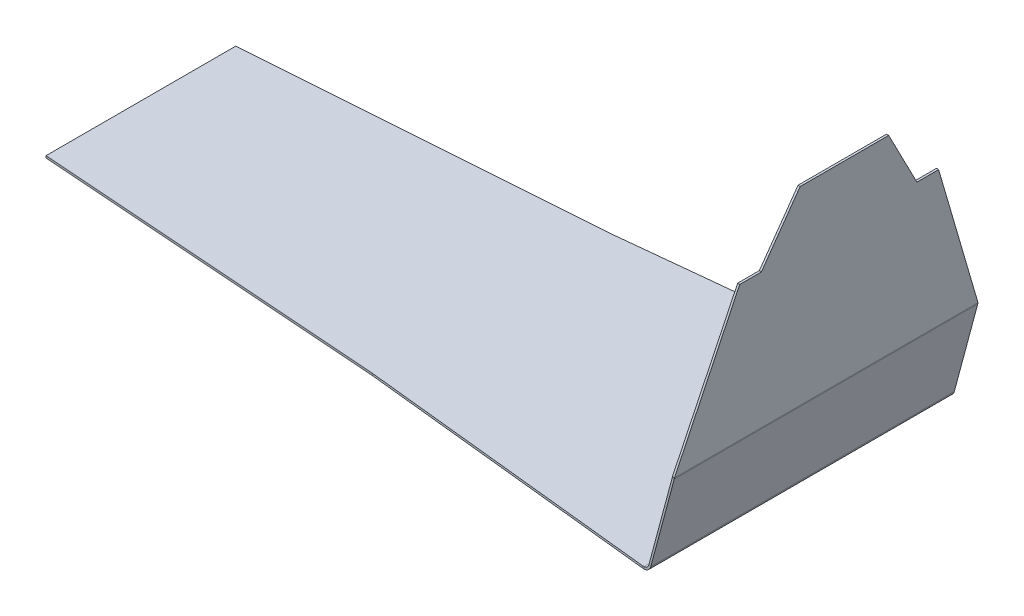
ISO-10303-21;
HEADER;
FILE_DESCRIPTION(('STEP AP214'),'2;1');
FILE_NAME('part.step','',(''),(''),'','','');
FILE_SCHEMA(('AUTOMOTIVE_DESIGN { 1 0 10303 214 1 1 1 1 }'));
ENDSEC;
DATA;
#1=APPLICATION_CONTEXT('core data for automotive mechanical design processes');
#2=APPLICATION_PROTOCOL_DEFINITION('international standard','automotive_design',2000,#1);
#3=PRODUCT_CONTEXT('',#1,'mechanical');
#4=PRODUCT('Part','Part','',(#3));
#5=PRODUCT_RELATED_PRODUCT_CATEGORY('part','',(#4));
#6=PRODUCT_DEFINITION_FORMATION('','',#4);
#7=PRODUCT_DEFINITION_CONTEXT('part definition',#1,'design');
#8=PRODUCT_DEFINITION('design','',#6,#7);
#9=PRODUCT_DEFINITION_SHAPE('','',#8);
#10=(LENGTH_UNIT() NAMED_UNIT(*) SI_UNIT(.MILLI.,.METRE.));
#11=(NAMED_UNIT(*) PLANE_ANGLE_UNIT() SI_UNIT($,.RADIAN.));
#12=(NAMED_UNIT(*) SI_UNIT($,.STERADIAN.) SOLID_ANGLE_UNIT());
#13=UNCERTAINTY_MEASURE_WITH_UNIT(LENGTH_MEASURE(1.E-05),#10,'distance_accuracy_value','');
#14=(GEOMETRIC_REPRESENTATION_CONTEXT(3) GLOBAL_UNCERTAINTY_ASSIGNED_CONTEXT((#13)) GLOBAL_UNIT_ASSIGNED_CONTEXT((#10,
#11,#12)) REPRESENTATION_CONTEXT('',''));
#15=CARTESIAN_POINT('',(0.,0.,0.));
#16=DIRECTION('',(0.,0.,1.));
#17=DIRECTION('',(1.,0.,0.));
#18=AXIS2_PLACEMENT_3D('',#15,#16,#17);
#19=CARTESIAN_POINT('',(446.934065691937,-39.1016640915989,-1.22240307231145E-13));
#20=DIRECTION('',(0.996194698091745,-0.0871557427476666,0.));
#21=DIRECTION('',(0.0871557427476666,0.996194698091745,0.));
#22=AXIS2_PLACEMENT_3D('',#19,#20,#21);
#23=PLANE('',#22);
#24=DIRECTION('',(0.,0.,-1.));
#25=VECTOR('',#24,1.);
#26=CARTESIAN_POINT('',(503.063220608211,602.45751231115,-300.));
#27=LINE('',#26,#25);
#28=CARTESIAN_POINT('',(503.063220608211,602.45751231115,87.5516477613444));
#29=VERTEX_POINT('',#28);
#30=CARTESIAN_POINT('',(503.063220608211,602.45751231115,-87.5516477613445));
#31=VERTEX_POINT('',#30);
#32=EDGE_CURVE('E331',#29,#31,#27,.T.);
#33=ORIENTED_EDGE('',*,*,#32,.F.);
#34=DIRECTION('',(-0.076110943801157,-0.869952068459671,0.487227383073281));
#35=VECTOR('',#34,1.);
#36=CARTESIAN_POINT('',(463.505302291546,150.308436963351,340.783312732004));
#37=LINE('',#36,#35);
#38=CARTESIAN_POINT('',(492.714619418007,484.172459446715,153.79865015754));
#39=VERTEX_POINT('',#38);
#40=EDGE_CURVE('E277',#29,#39,#37,.T.);
#41=ORIENTED_EDGE('',*,*,#40,.T.);
#42=DIRECTION('',(0.,0.,1.));
#43=VECTOR('',#42,1.);
#44=CARTESIAN_POINT('',(492.714619418008,484.172459446715,-1.81627154925868E-13));
#45=LINE('',#44,#43);
#46=CARTESIAN_POINT('',(492.714619418008,484.172459446715,196.591479546335));
#47=VERTEX_POINT('',#46);
#48=EDGE_CURVE('E284',#39,#47,#45,.T.);
#49=ORIENTED_EDGE('',*,*,#48,.T.);
#50=DIRECTION('',(-0.0821947035906193,-0.939489761050654,0.332570322762923));
#51=VECTOR('',#50,1.);
#52=CARTESIAN_POINT('',(457.37146331674,80.198336664604,339.594426434514));
#53=LINE('',#52,#51);
#54=CARTESIAN_POINT('',(467.157219657198,192.050043458108,300.));
#55=VERTEX_POINT('',#54);
#56=EDGE_CURVE('E271',#47,#55,#53,.T.);
#57=ORIENTED_EDGE('',*,*,#56,.T.);
#58=DIRECTION('',(0.,0.,-1.));
#59=VECTOR('',#58,1.);
#60=CARTESIAN_POINT('',(467.157219657198,192.050043458108,-2.5616833397339E-13));
#61=LINE('',#60,#59);
#62=CARTESIAN_POINT('',(467.157219657198,192.050043458108,-300.));
#63=VERTEX_POINT('',#62);
#64=EDGE_CURVE('E327',#55,#63,#61,.T.);
#65=ORIENTED_EDGE('',*,*,#64,.T.);
#66=DIRECTION('',(0.0821947035906195,0.939489761050654,0.332570322762923));
#67=VECTOR('',#66,1.);
#68=CARTESIAN_POINT('',(457.37146331674,80.1983366646043,-339.594426434515));
#69=LINE('',#68,#67);
#70=CARTESIAN_POINT('',(492.714619418007,484.172459446715,-196.591479546335));
#71=VERTEX_POINT('',#70);
#72=EDGE_CURVE('E300',#63,#71,#69,.T.);
#73=ORIENTED_EDGE('',*,*,#72,.T.);
#74=DIRECTION('',(0.,0.,1.));
#75=VECTOR('',#74,1.);
#76=CARTESIAN_POINT('',(492.714619418008,484.172459446715,-1.22240307231145E-13));
#77=LINE('',#76,#75);
#78=CARTESIAN_POINT('',(492.714619418008,484.172459446715,-153.79865015754));
#79=VERTEX_POINT('',#78);
#80=EDGE_CURVE('E307',#71,#79,#77,.T.);
#81=ORIENTED_EDGE('',*,*,#80,.T.);
#82=DIRECTION('',(0.0761109438011572,0.86995206845967,0.487227383073282));
#83=VECTOR('',#82,1.);
#84=CARTESIAN_POINT('',(463.505302291546,150.308436963352,-340.783312732004));
#85=LINE('',#84,#83);
#86=EDGE_CURVE('E294',#79,#31,#85,.T.);
#87=ORIENTED_EDGE('',*,*,#86,.T.);
#88=EDGE_LOOP('',(#33,#41,#49,#57,#65,#73,#81,#87));
#89=FACE_BOUND('',#88,.T.);
#90=ADVANCED_FACE('F61',(#89),#23,.T.);
#91=CARTESIAN_POINT('',(442.94928689957,-38.7530411206082,-1.21150435992368E-13));
#92=DIRECTION('',(0.996194698091745,-0.0871557427476666,0.));
#93=DIRECTION('',(0.0871557427476666,0.996194698091745,0.));
#94=AXIS2_PLACEMENT_3D('',#91,#92,#93);
#95=PLANE('',#94);
#96=DIRECTION('',(-0.076110943801157,-0.869952068459671,0.487227383073281));
#97=VECTOR('',#96,1.);
#98=CARTESIAN_POINT('',(459.520523499179,150.657059934342,340.783312732004));
#99=LINE('',#98,#97);
#100=CARTESIAN_POINT('',(499.078441815844,602.806135282141,87.5516477613445));
#101=VERTEX_POINT('',#100);
#102=CARTESIAN_POINT('',(488.729840625641,484.521082417706,153.79865015754));
#103=VERTEX_POINT('',#102);
#104=EDGE_CURVE('E278',#101,#103,#99,.T.);
#105=ORIENTED_EDGE('',*,*,#104,.F.);
#106=DIRECTION('',(0.,0.,-1.));
#107=VECTOR('',#106,1.);
#108=CARTESIAN_POINT('',(499.078441815844,602.80613528214,-300.));
#109=LINE('',#108,#107);
#110=CARTESIAN_POINT('',(499.078441815844,602.80613528214,-87.5516477613445));
#111=VERTEX_POINT('',#110);
#112=EDGE_CURVE('E77',#101,#111,#109,.T.);
#113=ORIENTED_EDGE('',*,*,#112,.T.);
#114=DIRECTION('',(0.0761109438011572,0.86995206845967,0.487227383073282));
#115=VECTOR('',#114,1.);
#116=CARTESIAN_POINT('',(459.520523499179,150.657059934342,-340.783312732004));
#117=LINE('',#116,#115);
#118=CARTESIAN_POINT('',(488.729840625641,484.521082417706,-153.79865015754));
#119=VERTEX_POINT('',#118);
#120=EDGE_CURVE('E297',#119,#111,#117,.T.);
#121=ORIENTED_EDGE('',*,*,#120,.F.);
#122=DIRECTION('',(0.,0.,1.));
#123=VECTOR('',#122,1.);
#124=CARTESIAN_POINT('',(488.729840625641,484.521082417706,-1.21150435992368E-13));
#125=LINE('',#124,#123);
#126=CARTESIAN_POINT('',(488.729840625641,484.521082417706,-196.591479546335));
#127=VERTEX_POINT('',#126);
#128=EDGE_CURVE('E299',#127,#119,#125,.T.);
#129=ORIENTED_EDGE('',*,*,#128,.F.);
#130=DIRECTION('',(0.0821947035906195,0.939489761050654,0.332570322762923));
#131=VECTOR('',#130,1.);
#132=CARTESIAN_POINT('',(453.386684524373,80.5469596355949,-339.594426434515));
#133=LINE('',#132,#131);
#134=CARTESIAN_POINT('',(463.172440864831,192.398666429099,-300.));
#135=VERTEX_POINT('',#134);
#136=EDGE_CURVE('E301',#135,#127,#133,.T.);
#137=ORIENTED_EDGE('',*,*,#136,.F.);
#138=DIRECTION('',(0.,0.,-1.));
#139=VECTOR('',#138,1.);
#140=CARTESIAN_POINT('',(463.172440864831,192.398666429099,300.));
#141=LINE('',#140,#139);
#142=CARTESIAN_POINT('',(463.172440864831,192.398666429099,300.));
#143=VERTEX_POINT('',#142);
#144=EDGE_CURVE('E321',#143,#135,#141,.T.);
#145=ORIENTED_EDGE('',*,*,#144,.F.);
#146=DIRECTION('',(-0.0821947035906193,-0.939489761050654,0.332570322762923));
#147=VECTOR('',#146,1.);
#148=CARTESIAN_POINT('',(453.386684524373,80.5469596355947,339.594426434514));
#149=LINE('',#148,#147);
#150=CARTESIAN_POINT('',(488.729840625641,484.521082417706,196.591479546335));
#151=VERTEX_POINT('',#150);
#152=EDGE_CURVE('E274',#151,#143,#149,.T.);
#153=ORIENTED_EDGE('',*,*,#152,.F.);
#154=DIRECTION('',(0.,0.,1.));
#155=VECTOR('',#154,1.);
#156=CARTESIAN_POINT('',(488.729840625641,484.521082417706,-1.21150435992368E-13));
#157=LINE('',#156,#155);
#158=EDGE_CURVE('E276',#103,#151,#157,.T.);
#159=ORIENTED_EDGE('',*,*,#158,.F.);
#160=EDGE_LOOP('',(#105,#113,#121,#129,#137,#145,#153,#159));
#161=FACE_BOUND('',#160,.T.);
#162=ADVANCED_FACE('F426',(#161),#95,.F.);
#163=CARTESIAN_POINT('',(503.063220608211,602.45751231115,-300.));
#164=DIRECTION('',(0.0871557427476667,0.996194698091745,0.));
#165=DIRECTION('',(-0.996194698091745,0.0871557427476667,0.));
#166=AXIS2_PLACEMENT_3D('',#163,#164,#165);
#167=PLANE('',#166);
#168=ORIENTED_EDGE('',*,*,#112,.F.);
#169=DIRECTION('',(0.996194698091745,-0.0871557427476666,0.));
#170=VECTOR('',#169,1.);
#171=CARTESIAN_POINT('',(503.063220608211,602.45751231115,87.5516477613444));
#172=LINE('',#171,#170);
#173=EDGE_CURVE('E289',#29,#101,#172,.F.);
#174=ORIENTED_EDGE('',*,*,#173,.F.);
#175=ORIENTED_EDGE('',*,*,#32,.T.);
#176=DIRECTION('',(0.996194698091745,-0.0871557427476666,0.));
#177=VECTOR('',#176,1.);
#178=CARTESIAN_POINT('',(503.063220608211,602.45751231115,-87.5516477613445));
#179=LINE('',#178,#177);
#180=EDGE_CURVE('E312',#31,#111,#179,.F.);
#181=ORIENTED_EDGE('',*,*,#180,.T.);
#182=EDGE_LOOP('',(#168,#174,#175,#181));
#183=FACE_BOUND('',#182,.T.);
#184=ADVANCED_FACE('F460',(#183),#167,.T.);
#185=CARTESIAN_POINT('',(466.959892775471,190.491832821212,-300.));
#186=DIRECTION('',(0.,0.,1.));
#187=DIRECTION('',(1.,0.,0.));
#188=AXIS2_PLACEMENT_3D('',#185,#186,#187);
#189=PLANE('',#188);
#190=DIRECTION('',(0.965925826289072,-0.258819045102507,0.));
#191=VECTOR('',#190,1.);
#192=CARTESIAN_POINT('',(462.869752146806,190.682033405549,-300.));
#193=LINE('',#192,#191);
#194=CARTESIAN_POINT('',(462.869752146804,190.68203340555,-300.));
#195=VERTEX_POINT('',#194);
#196=CARTESIAN_POINT('',(466.733455451962,189.646757225139,-300.));
#197=VERTEX_POINT('',#196);
#198=EDGE_CURVE('E341',#195,#197,#193,.T.);
#199=ORIENTED_EDGE('',*,*,#198,.T.);
#200=DIRECTION('',(0.258819045102524,0.965925826289067,0.));
#201=VECTOR('',#200,1.);
#202=CARTESIAN_POINT('',(388.726426009517,-101.479440001577,-300.));
#203=LINE('',#202,#201);
#204=CARTESIAN_POINT('',(420.30583889723,16.3765333685647,-300.));
#205=VERTEX_POINT('',#204);
#206=EDGE_CURVE('E359',#205,#197,#203,.T.);
#207=ORIENTED_EDGE('',*,*,#206,.F.);
#208=DIRECTION('',(-0.965925826289068,0.258819045102524,0.));
#209=VECTOR('',#208,1.);
#210=CARTESIAN_POINT('',(416.442135592074,17.4118095489749,-300.));
#211=LINE('',#210,#209);
#212=CARTESIAN_POINT('',(416.442135592074,17.4118095489748,-300.));
#213=VERTEX_POINT('',#212);
#214=EDGE_CURVE('E368',#213,#205,#211,.F.);
#215=ORIENTED_EDGE('',*,*,#214,.F.);
#216=DIRECTION('',(-0.258819045102524,-0.965925826289067,0.));
#217=VECTOR('',#216,1.);
#218=CARTESIAN_POINT('',(463.096189470315,191.527109001622,-300.));
#219=LINE('',#218,#217);
#220=EDGE_CURVE('E363',#213,#195,#219,.F.);
#221=ORIENTED_EDGE('',*,*,#220,.T.);
#222=EDGE_LOOP('',(#199,#207,#215,#221));
#223=FACE_BOUND('',#222,.T.);
#224=ADVANCED_FACE('F413',(#223),#189,.F.);
#225=CARTESIAN_POINT('',(418.319850514129,8.9647238195899,300.));
#226=DIRECTION('',(0.,0.,-1.));
#227=DIRECTION('',(-1.,0.,0.));
#228=AXIS2_PLACEMENT_3D('',#225,#226,#227);
#229=PLANE('',#228);
#230=DIRECTION('',(0.965925826289072,-0.258819045102507,0.));
#231=VECTOR('',#230,1.);
#232=CARTESIAN_POINT('',(462.869752146804,190.68203340555,300.));
#233=LINE('',#232,#231);
#234=CARTESIAN_POINT('',(462.869752146804,190.68203340555,300.));
#235=VERTEX_POINT('',#234);
#236=CARTESIAN_POINT('',(466.73345545196,189.64675722514,300.));
#237=VERTEX_POINT('',#236);
#238=EDGE_CURVE('E350',#235,#237,#233,.T.);
#239=ORIENTED_EDGE('',*,*,#238,.F.);
#240=DIRECTION('',(0.258819045102524,0.965925826289067,0.));
#241=VECTOR('',#240,1.);
#242=CARTESIAN_POINT('',(414.456147208973,9.99999999999998,300.));
#243=LINE('',#242,#241);
#244=CARTESIAN_POINT('',(416.442135592074,17.4118095489747,300.));
#245=VERTEX_POINT('',#244);
#246=EDGE_CURVE('E361',#235,#245,#243,.F.);
#247=ORIENTED_EDGE('',*,*,#246,.T.);
#248=DIRECTION('',(-0.965925826289068,0.258819045102524,0.));
#249=VECTOR('',#248,1.);
#250=CARTESIAN_POINT('',(420.305838897231,16.3765333685647,300.));
#251=LINE('',#250,#249);
#252=CARTESIAN_POINT('',(420.305838897231,16.3765333685646,300.));
#253=VERTEX_POINT('',#252);
#254=EDGE_CURVE('E353',#245,#253,#251,.F.);
#255=ORIENTED_EDGE('',*,*,#254,.T.);
#256=DIRECTION('',(-0.258819045102524,-0.965925826289067,0.));
#257=VECTOR('',#256,1.);
#258=CARTESIAN_POINT('',(388.726426009517,-101.479440001577,300.));
#259=LINE('',#258,#257);
#260=EDGE_CURVE('E356',#237,#253,#259,.T.);
#261=ORIENTED_EDGE('',*,*,#260,.F.);
#262=EDGE_LOOP('',(#239,#247,#255,#261));
#263=FACE_BOUND('',#262,.T.);
#264=ADVANCED_FACE('F446',(#263),#229,.F.);
#265=CARTESIAN_POINT('',(388.726426009517,-101.479440001577,-1.10216495095742E-13));
#266=DIRECTION('',(-0.965925826289068,0.258819045102524,0.));
#267=DIRECTION('',(-0.258819045102524,-0.965925826289067,0.));
#268=AXIS2_PLACEMENT_3D('',#265,#266,#267);
#269=PLANE('',#268);
#270=DIRECTION('',(0.,0.,-1.));
#271=VECTOR('',#270,1.);
#272=CARTESIAN_POINT('',(466.733455451962,189.646757225139,-300.));
#273=LINE('',#272,#271);
#274=EDGE_CURVE('E335',#197,#237,#273,.F.);
#275=ORIENTED_EDGE('',*,*,#274,.T.);
#276=ORIENTED_EDGE('',*,*,#260,.T.);
#277=DIRECTION('',(0.,0.,-1.));
#278=VECTOR('',#277,1.);
#279=CARTESIAN_POINT('',(420.305838897231,16.3765333685646,300.));
#280=LINE('',#279,#278);
#281=EDGE_CURVE('E365',#205,#253,#280,.F.);
#282=ORIENTED_EDGE('',*,*,#281,.F.);
#283=ORIENTED_EDGE('',*,*,#206,.T.);
#284=EDGE_LOOP('',(#275,#276,#282,#283));
#285=FACE_BOUND('',#284,.T.);
#286=ADVANCED_FACE('F443',(#285),#269,.F.);
#287=CARTESIAN_POINT('',(384.86272270436,-100.444163821167,-1.09144102003316E-13));
#288=DIRECTION('',(-0.965925826289068,0.258819045102524,0.));
#289=DIRECTION('',(-0.258819045102524,-0.965925826289067,0.));
#290=AXIS2_PLACEMENT_3D('',#287,#288,#289);
#291=PLANE('',#290);
#292=ORIENTED_EDGE('',*,*,#246,.F.);
#293=DIRECTION('',(0.,0.,-1.));
#294=VECTOR('',#293,1.);
#295=CARTESIAN_POINT('',(462.869752146806,190.682033405549,-300.));
#296=LINE('',#295,#294);
#297=EDGE_CURVE('E85',#195,#235,#296,.F.);
#298=ORIENTED_EDGE('',*,*,#297,.F.);
#299=ORIENTED_EDGE('',*,*,#220,.F.);
#300=DIRECTION('',(0.,0.,-1.));
#301=VECTOR('',#300,1.);
#302=CARTESIAN_POINT('',(416.442135592074,17.4118095489747,300.));
#303=LINE('',#302,#301);
#304=EDGE_CURVE('E371',#245,#213,#303,.T.);
#305=ORIENTED_EDGE('',*,*,#304,.F.);
#306=EDGE_LOOP('',(#292,#298,#299,#305));
#307=FACE_BOUND('',#306,.T.);
#308=ADVANCED_FACE('F409',(#307),#291,.T.);
#309=CARTESIAN_POINT('',(-192.279765905027,10.,-237.5));
#310=DIRECTION('',(0.104166666666667,0.,0.994559855190001));
#311=DIRECTION('',(-0.994559855190001,0.,0.104166666666667));
#312=AXIS2_PLACEMENT_3D('',#309,#310,#311);
#313=PLANE('',#312);
#314=DIRECTION('',(0.,1.,0.));
#315=VECTOR('',#314,1.);
#316=CARTESIAN_POINT('',(404.456147208973,10.,-300.));
#317=LINE('',#316,#315);
#318=CARTESIAN_POINT('',(404.456147208973,6.00000000000001,-300.));
#319=VERTEX_POINT('',#318);
#320=CARTESIAN_POINT('',(404.456147208973,10.,-300.));
#321=VERTEX_POINT('',#320);
#322=EDGE_CURVE('E70',#319,#321,#317,.T.);
#323=ORIENTED_EDGE('',*,*,#322,.F.);
#324=DIRECTION('',(-0.994559855190001,0.,0.104166666666667));
#325=VECTOR('',#324,1.);
#326=CARTESIAN_POINT('',(-192.279765905027,6.,-237.5));
#327=LINE('',#326,#325);
#328=CARTESIAN_POINT('',(-192.279765905027,6.,-237.5));
#329=VERTEX_POINT('',#328);
#330=EDGE_CURVE('E220',#319,#329,#327,.T.);
#331=ORIENTED_EDGE('',*,*,#330,.T.);
#332=DIRECTION('',(0.,1.,0.));
#333=VECTOR('',#332,1.);
#334=CARTESIAN_POINT('',(-192.279765905027,10.,-237.5));
#335=LINE('',#334,#333);
#336=CARTESIAN_POINT('',(-192.279765905027,10.,-237.5));
#337=VERTEX_POINT('',#336);
#338=EDGE_CURVE('E203',#329,#337,#335,.T.);
#339=ORIENTED_EDGE('',*,*,#338,.T.);
#340=DIRECTION('',(-0.994559855190001,0.,0.104166666666667));
#341=VECTOR('',#340,1.);
#342=CARTESIAN_POINT('',(-192.279765905027,10.,-237.5));
#343=LINE('',#342,#341);
#344=EDGE_CURVE('E232',#321,#337,#343,.T.);
#345=ORIENTED_EDGE('',*,*,#344,.F.);
#346=EDGE_LOOP('',(#323,#331,#339,#345));
#347=FACE_BOUND('',#346,.T.);
#348=ADVANCED_FACE('F227',(#347),#313,.F.);
#349=CARTESIAN_POINT('',(404.456147208973,10.,300.));
#350=DIRECTION('',(0.104166666666667,0.,-0.994559855190001));
#351=DIRECTION('',(0.994559855190001,0.,0.104166666666667));
#352=AXIS2_PLACEMENT_3D('',#349,#350,#351);
#353=PLANE('',#352);
#354=DIRECTION('',(0.994559855190001,0.,0.104166666666667));
#355=VECTOR('',#354,1.);
#356=CARTESIAN_POINT('',(404.456147208973,6.,300.));
#357=LINE('',#356,#355);
#358=CARTESIAN_POINT('',(-192.279765905027,6.,237.5));
#359=VERTEX_POINT('',#358);
#360=CARTESIAN_POINT('',(404.456147208973,5.99999999999991,300.));
#361=VERTEX_POINT('',#360);
#362=EDGE_CURVE('E229',#359,#361,#357,.T.);
#363=ORIENTED_EDGE('',*,*,#362,.T.);
#364=DIRECTION('',(0.,1.,0.));
#365=VECTOR('',#364,1.);
#366=CARTESIAN_POINT('',(404.456147208973,10.,300.));
#367=LINE('',#366,#365);
#368=CARTESIAN_POINT('',(404.456147208973,9.99999999999991,300.));
#369=VERTEX_POINT('',#368);
#370=EDGE_CURVE('E13',#361,#369,#367,.T.);
#371=ORIENTED_EDGE('',*,*,#370,.T.);
#372=DIRECTION('',(0.994559855190001,0.,0.104166666666667));
#373=VECTOR('',#372,1.);
#374=CARTESIAN_POINT('',(404.456147208973,10.,300.));
#375=LINE('',#374,#373);
#376=CARTESIAN_POINT('',(-192.279765905027,10.,237.5));
#377=VERTEX_POINT('',#376);
#378=EDGE_CURVE('E228',#377,#369,#375,.T.);
#379=ORIENTED_EDGE('',*,*,#378,.F.);
#380=DIRECTION('',(0.,1.,0.));
#381=VECTOR('',#380,1.);
#382=CARTESIAN_POINT('',(-192.279765905027,10.,237.5));
#383=LINE('',#382,#381);
#384=EDGE_CURVE('E65',#359,#377,#383,.T.);
#385=ORIENTED_EDGE('',*,*,#384,.F.);
#386=EDGE_LOOP('',(#363,#371,#379,#385));
#387=FACE_BOUND('',#386,.T.);
#388=ADVANCED_FACE('F63',(#387),#353,.F.);
#389=CARTESIAN_POINT('',(0.,10.,0.));
#390=DIRECTION('',(0.,-1.,0.));
#391=DIRECTION('',(0.,0.,-1.));
#392=AXIS2_PLACEMENT_3D('',#389,#390,#391);
#393=PLANE('',#392);
#394=ORIENTED_EDGE('',*,*,#344,.T.);
#395=DIRECTION('',(-0.997424045057118,0.,0.0717305676953388));
#396=VECTOR('',#395,1.);
#397=CARTESIAN_POINT('',(-192.279765905027,10.,-237.5));
#398=LINE('',#397,#396);
#399=CARTESIAN_POINT('',(-887.537085834154,10.,-187.5));
#400=VERTEX_POINT('',#399);
#401=EDGE_CURVE('E208',#337,#400,#398,.T.);
#402=ORIENTED_EDGE('',*,*,#401,.T.);
#403=DIRECTION('',(0.,0.,1.));
#404=VECTOR('',#403,1.);
#405=CARTESIAN_POINT('',(-887.537085834154,10.,-187.5));
#406=LINE('',#405,#404);
#407=CARTESIAN_POINT('',(-887.537085834154,10.,187.5));
#408=VERTEX_POINT('',#407);
#409=EDGE_CURVE('E264',#400,#408,#406,.T.);
#410=ORIENTED_EDGE('',*,*,#409,.T.);
#411=DIRECTION('',(0.997424045057118,0.,0.0717305676953386));
#412=VECTOR('',#411,1.);
#413=CARTESIAN_POINT('',(-192.279765905027,10.,237.5));
#414=LINE('',#413,#412);
#415=EDGE_CURVE('E224',#408,#377,#414,.T.);
#416=ORIENTED_EDGE('',*,*,#415,.T.);
#417=ORIENTED_EDGE('',*,*,#378,.T.);
#418=DIRECTION('',(-1.,0.,0.));
#419=VECTOR('',#418,1.);
#420=CARTESIAN_POINT('',(406.782877329183,9.9999999999999,300.));
#421=LINE('',#420,#419);
#422=CARTESIAN_POINT('',(406.782877329183,9.9999999999999,300.));
#423=VERTEX_POINT('',#422);
#424=EDGE_CURVE('E260',#423,#369,#421,.T.);
#425=ORIENTED_EDGE('',*,*,#424,.F.);
#426=DIRECTION('',(0.,0.,-1.));
#427=VECTOR('',#426,1.);
#428=CARTESIAN_POINT('',(406.782877329183,10.,-300.));
#429=LINE('',#428,#427);
#430=CARTESIAN_POINT('',(406.782877329183,10.,-300.));
#431=VERTEX_POINT('',#430);
#432=EDGE_CURVE('E249',#431,#423,#429,.F.);
#433=ORIENTED_EDGE('',*,*,#432,.F.);
#434=DIRECTION('',(-1.,0.,0.));
#435=VECTOR('',#434,1.);
#436=CARTESIAN_POINT('',(406.782877329183,10.,-300.));
#437=LINE('',#436,#435);
#438=EDGE_CURVE('E235',#431,#321,#437,.T.);
#439=ORIENTED_EDGE('',*,*,#438,.T.);
#440=EDGE_LOOP('',(#394,#402,#410,#416,#417,#425,#433,#439));
#441=FACE_BOUND('',#440,.T.);
#442=ADVANCED_FACE('F247',(#441),#393,.F.);
#443=CARTESIAN_POINT('',(0.,6.,0.));
#444=DIRECTION('',(0.,-1.,0.));
#445=DIRECTION('',(0.,0.,-1.));
#446=AXIS2_PLACEMENT_3D('',#443,#444,#445);
#447=PLANE('',#446);
#448=ORIENTED_EDGE('',*,*,#362,.F.);
#449=DIRECTION('',(0.997424045057118,0.,0.0717305676953386));
#450=VECTOR('',#449,1.);
#451=CARTESIAN_POINT('',(-192.279765905027,6.,237.5));
#452=LINE('',#451,#450);
#453=CARTESIAN_POINT('',(-887.537085834154,6.,187.5));
#454=VERTEX_POINT('',#453);
#455=EDGE_CURVE('E257',#454,#359,#452,.T.);
#456=ORIENTED_EDGE('',*,*,#455,.F.);
#457=DIRECTION('',(0.,0.,1.));
#458=VECTOR('',#457,1.);
#459=CARTESIAN_POINT('',(-887.537085834154,6.,-187.5));
#460=LINE('',#459,#458);
#461=CARTESIAN_POINT('',(-887.537085834154,6.,-187.5));
#462=VERTEX_POINT('',#461);
#463=EDGE_CURVE('E223',#462,#454,#460,.T.);
#464=ORIENTED_EDGE('',*,*,#463,.F.);
#465=DIRECTION('',(-0.997424045057118,0.,0.0717305676953388));
#466=VECTOR('',#465,1.);
#467=CARTESIAN_POINT('',(-192.279765905027,6.,-237.5));
#468=LINE('',#467,#466);
#469=EDGE_CURVE('E206',#329,#462,#468,.T.);
#470=ORIENTED_EDGE('',*,*,#469,.F.);
#471=ORIENTED_EDGE('',*,*,#330,.F.);
#472=DIRECTION('',(-1.,0.,0.));
#473=VECTOR('',#472,1.);
#474=CARTESIAN_POINT('',(406.782877329183,6.,-300.));
#475=LINE('',#474,#473);
#476=CARTESIAN_POINT('',(406.782877329183,6.,-300.));
#477=VERTEX_POINT('',#476);
#478=EDGE_CURVE('E245',#477,#319,#475,.T.);
#479=ORIENTED_EDGE('',*,*,#478,.F.);
#480=DIRECTION('',(0.,0.,-1.));
#481=VECTOR('',#480,1.);
#482=CARTESIAN_POINT('',(406.782877329183,6.,-300.));
#483=LINE('',#482,#481);
#484=CARTESIAN_POINT('',(406.782877329183,5.9999999999999,300.));
#485=VERTEX_POINT('',#484);
#486=EDGE_CURVE('E375',#477,#485,#483,.F.);
#487=ORIENTED_EDGE('',*,*,#486,.T.);
#488=DIRECTION('',(-1.,0.,0.));
#489=VECTOR('',#488,1.);
#490=CARTESIAN_POINT('',(406.782877329183,5.9999999999999,300.));
#491=LINE('',#490,#489);
#492=EDGE_CURVE('E395',#485,#361,#491,.T.);
#493=ORIENTED_EDGE('',*,*,#492,.T.);
#494=EDGE_LOOP('',(#448,#456,#464,#470,#471,#479,#487,#493));
#495=FACE_BOUND('',#494,.T.);
#496=ADVANCED_FACE('F218',(#495),#447,.T.);
#497=CARTESIAN_POINT('',(406.782877329183,10.,-300.));
#498=DIRECTION('',(0.,0.,-1.));
#499=DIRECTION('',(0.,-1.,0.));
#500=AXIS2_PLACEMENT_3D('',#497,#498,#499);
#501=PLANE('',#500);
#502=ORIENTED_EDGE('',*,*,#438,.F.);
#503=DIRECTION('',(0.,-1.,0.));
#504=VECTOR('',#503,1.);
#505=CARTESIAN_POINT('',(406.782877329183,10.,-300.));
#506=LINE('',#505,#504);
#507=EDGE_CURVE('E382',#431,#477,#506,.T.);
#508=ORIENTED_EDGE('',*,*,#507,.T.);
#509=ORIENTED_EDGE('',*,*,#478,.T.);
#510=ORIENTED_EDGE('',*,*,#322,.T.);
#511=EDGE_LOOP('',(#502,#508,#509,#510));
#512=FACE_BOUND('',#511,.T.);
#513=ADVANCED_FACE('F242',(#512),#501,.T.);
#514=CARTESIAN_POINT('',(406.782877329183,9.9999999999999,300.));
#515=DIRECTION('',(0.,0.,-1.));
#516=DIRECTION('',(0.,-1.,0.));
#517=AXIS2_PLACEMENT_3D('',#514,#515,#516);
#518=PLANE('',#517);
#519=ORIENTED_EDGE('',*,*,#492,.F.);
#520=DIRECTION('',(0.,-1.,0.));
#521=VECTOR('',#520,1.);
#522=CARTESIAN_POINT('',(406.782877329183,9.9999999999999,300.));
#523=LINE('',#522,#521);
#524=EDGE_CURVE('E391',#423,#485,#523,.T.);
#525=ORIENTED_EDGE('',*,*,#524,.F.);
#526=ORIENTED_EDGE('',*,*,#424,.T.);
#527=ORIENTED_EDGE('',*,*,#370,.F.);
#528=EDGE_LOOP('',(#519,#525,#526,#527));
#529=FACE_BOUND('',#528,.T.);
#530=ADVANCED_FACE('F400',(#529),#518,.F.);
#531=CARTESIAN_POINT('',(406.782877329184,20.,300.));
#532=DIRECTION('',(0.,0.,1.));
#533=DIRECTION('',(0.,-1.,0.));
#534=AXIS2_PLACEMENT_3D('',#531,#532,#533);
#535=PLANE('',#534);
#536=ORIENTED_EDGE('',*,*,#254,.F.);
#537=CARTESIAN_POINT('',(406.782877329184,20.,300.));
#538=DIRECTION('',(0.,0.,-1.));
#539=DIRECTION('',(0.,1.,0.));
#540=AXIS2_PLACEMENT_3D('',#537,#538,#539);
#541=CIRCLE('',#540,10.0000000000001);
#542=EDGE_CURVE('E385',#423,#245,#541,.F.);
#543=ORIENTED_EDGE('',*,*,#542,.F.);
#544=ORIENTED_EDGE('',*,*,#524,.T.);
#545=CARTESIAN_POINT('',(406.782877329184,20.,300.));
#546=DIRECTION('',(0.,0.,-1.));
#547=DIRECTION('',(0.,1.,0.));
#548=AXIS2_PLACEMENT_3D('',#545,#546,#547);
#549=CIRCLE('',#548,14.0000000000001);
#550=EDGE_CURVE('E378',#485,#253,#549,.F.);
#551=ORIENTED_EDGE('',*,*,#550,.T.);
#552=EDGE_LOOP('',(#536,#543,#544,#551));
#553=FACE_BOUND('',#552,.T.);
#554=ADVANCED_FACE('F404',(#553),#535,.T.);
#555=CARTESIAN_POINT('',(406.782877329184,20.0000000000001,-300.));
#556=DIRECTION('',(0.,0.,1.));
#557=DIRECTION('',(0.,-1.,0.));
#558=AXIS2_PLACEMENT_3D('',#555,#556,#557);
#559=PLANE('',#558);
#560=CARTESIAN_POINT('',(406.782877329184,20.0000000000001,-300.));
#561=DIRECTION('',(0.,0.,-1.));
#562=DIRECTION('',(0.,1.,0.));
#563=AXIS2_PLACEMENT_3D('',#560,#561,#562);
#564=CIRCLE('',#563,10.0000000000001);
#565=EDGE_CURVE('E358',#213,#431,#564,.T.);
#566=ORIENTED_EDGE('',*,*,#565,.F.);
#567=ORIENTED_EDGE('',*,*,#214,.T.);
#568=CARTESIAN_POINT('',(406.782877329184,20.0000000000001,-300.));
#569=DIRECTION('',(0.,0.,-1.));
#570=DIRECTION('',(0.,1.,0.));
#571=AXIS2_PLACEMENT_3D('',#568,#569,#570);
#572=CIRCLE('',#571,14.0000000000001);
#573=EDGE_CURVE('E379',#205,#477,#572,.T.);
#574=ORIENTED_EDGE('',*,*,#573,.T.);
#575=ORIENTED_EDGE('',*,*,#507,.F.);
#576=EDGE_LOOP('',(#566,#567,#574,#575));
#577=FACE_BOUND('',#576,.T.);
#578=ADVANCED_FACE('F501',(#577),#559,.F.);
#579=CARTESIAN_POINT('',(406.782877329184,20.0000000000001,-300.));
#580=DIRECTION('',(0.,0.,-1.));
#581=DIRECTION('',(0.965925826289067,-0.258819045102524,0.));
#582=AXIS2_PLACEMENT_3D('',#579,#580,#581);
#583=CYLINDRICAL_SURFACE('',#582,14.0000000000001);
#584=ORIENTED_EDGE('',*,*,#486,.F.);
#585=ORIENTED_EDGE('',*,*,#573,.F.);
#586=ORIENTED_EDGE('',*,*,#281,.T.);
#587=ORIENTED_EDGE('',*,*,#550,.F.);
#588=EDGE_LOOP('',(#584,#585,#586,#587));
#589=FACE_BOUND('',#588,.T.);
#590=ADVANCED_FACE('F498',(#589),#583,.T.);
#591=CARTESIAN_POINT('',(406.782877329184,20.0000000000001,-300.));
#592=DIRECTION('',(0.,0.,-1.));
#593=DIRECTION('',(0.965925826289067,-0.258819045102524,0.));
#594=AXIS2_PLACEMENT_3D('',#591,#592,#593);
#595=CYLINDRICAL_SURFACE('',#594,10.0000000000001);
#596=ORIENTED_EDGE('',*,*,#432,.T.);
#597=ORIENTED_EDGE('',*,*,#542,.T.);
#598=ORIENTED_EDGE('',*,*,#304,.T.);
#599=ORIENTED_EDGE('',*,*,#565,.T.);
#600=EDGE_LOOP('',(#596,#597,#598,#599));
#601=FACE_BOUND('',#600,.T.);
#602=ADVANCED_FACE('F407',(#601),#595,.F.);
#603=CARTESIAN_POINT('',(453.210493883912,193.270223856576,300.));
#604=DIRECTION('',(0.,0.,1.));
#605=DIRECTION('',(1.,0.,0.));
#606=AXIS2_PLACEMENT_3D('',#603,#604,#605);
#607=PLANE('',#606);
#608=DIRECTION('',(0.996194698091745,-0.0871557427476666,0.));
#609=VECTOR('',#608,1.);
#610=CARTESIAN_POINT('',(463.172440864831,192.398666429099,300.));
#611=LINE('',#610,#609);
#612=EDGE_CURVE('E318',#143,#55,#611,.T.);
#613=ORIENTED_EDGE('',*,*,#612,.F.);
#614=CARTESIAN_POINT('',(453.210493883912,193.270223856576,300.));
#615=DIRECTION('',(0.,0.,-1.));
#616=DIRECTION('',(-1.,0.,0.));
#617=AXIS2_PLACEMENT_3D('',#614,#615,#616);
#618=CIRCLE('',#617,10.0000000000016);
#619=EDGE_CURVE('E344',#235,#143,#618,.F.);
#620=ORIENTED_EDGE('',*,*,#619,.F.);
#621=ORIENTED_EDGE('',*,*,#238,.T.);
#622=CARTESIAN_POINT('',(453.210493883912,193.270223856576,300.));
#623=DIRECTION('',(0.,0.,-1.));
#624=DIRECTION('',(-1.,0.,0.));
#625=AXIS2_PLACEMENT_3D('',#622,#623,#624);
#626=CIRCLE('',#625,14.0000000000016);
#627=EDGE_CURVE('E337',#237,#55,#626,.F.);
#628=ORIENTED_EDGE('',*,*,#627,.T.);
#629=EDGE_LOOP('',(#613,#620,#621,#628));
#630=FACE_BOUND('',#629,.T.);
#631=ADVANCED_FACE('F449',(#630),#607,.T.);
#632=CARTESIAN_POINT('',(453.210493883914,193.270223856575,-300.));
#633=DIRECTION('',(0.,0.,1.));
#634=DIRECTION('',(1.,0.,0.));
#635=AXIS2_PLACEMENT_3D('',#632,#633,#634);
#636=PLANE('',#635);
#637=CARTESIAN_POINT('',(453.210493883914,193.270223856575,-300.));
#638=DIRECTION('',(0.,0.,-1.));
#639=DIRECTION('',(-1.,0.,0.));
#640=AXIS2_PLACEMENT_3D('',#637,#638,#639);
#641=CIRCLE('',#640,10.0000000000016);
#642=EDGE_CURVE('E333',#135,#195,#641,.T.);
#643=ORIENTED_EDGE('',*,*,#642,.F.);
#644=DIRECTION('',(0.996194698091745,-0.0871557427476666,0.));
#645=VECTOR('',#644,1.);
#646=CARTESIAN_POINT('',(463.172440864831,192.398666429098,-300.));
#647=LINE('',#646,#645);
#648=EDGE_CURVE('E324',#135,#63,#647,.T.);
#649=ORIENTED_EDGE('',*,*,#648,.T.);
#650=CARTESIAN_POINT('',(453.210493883914,193.270223856575,-300.));
#651=DIRECTION('',(0.,0.,-1.));
#652=DIRECTION('',(-1.,0.,0.));
#653=AXIS2_PLACEMENT_3D('',#650,#651,#652);
#654=CIRCLE('',#653,14.0000000000016);
#655=EDGE_CURVE('E338',#63,#197,#654,.T.);
#656=ORIENTED_EDGE('',*,*,#655,.T.);
#657=ORIENTED_EDGE('',*,*,#198,.F.);
#658=EDGE_LOOP('',(#643,#649,#656,#657));
#659=FACE_BOUND('',#658,.T.);
#660=ADVANCED_FACE('F418',(#659),#636,.F.);
#661=CARTESIAN_POINT('',(453.210493883914,193.270223856575,-300.));
#662=DIRECTION('',(0.,0.,-1.));
#663=DIRECTION('',(0.996194698091745,-0.0871557427476666,0.));
#664=AXIS2_PLACEMENT_3D('',#661,#662,#663);
#665=CYLINDRICAL_SURFACE('',#664,14.0000000000016);
#666=ORIENTED_EDGE('',*,*,#274,.F.);
#667=ORIENTED_EDGE('',*,*,#655,.F.);
#668=ORIENTED_EDGE('',*,*,#64,.F.);
#669=ORIENTED_EDGE('',*,*,#627,.F.);
#670=EDGE_LOOP('',(#666,#667,#668,#669));
#671=FACE_BOUND('',#670,.T.);
#672=ADVANCED_FACE('F439',(#671),#665,.T.);
#673=CARTESIAN_POINT('',(453.210493883914,193.270223856575,-300.));
#674=DIRECTION('',(0.,0.,-1.));
#675=DIRECTION('',(0.996194698091745,-0.0871557427476666,0.));
#676=AXIS2_PLACEMENT_3D('',#673,#674,#675);
#677=CYLINDRICAL_SURFACE('',#676,10.0000000000016);
#678=ORIENTED_EDGE('',*,*,#297,.T.);
#679=ORIENTED_EDGE('',*,*,#619,.T.);
#680=ORIENTED_EDGE('',*,*,#144,.T.);
#681=ORIENTED_EDGE('',*,*,#642,.T.);
#682=EDGE_LOOP('',(#678,#679,#680,#681));
#683=FACE_BOUND('',#682,.T.);
#684=ADVANCED_FACE('F421',(#683),#677,.F.);
#685=CARTESIAN_POINT('',(457.37146331674,80.1983366646043,-339.594426434515));
#686=DIRECTION('',(0.0289854134962335,0.331304792279084,-0.943078459311507));
#687=DIRECTION('',(0.0821947035906195,0.939489761050654,0.332570322762923));
#688=AXIS2_PLACEMENT_3D('',#685,#686,#687);
#689=PLANE('',#688);
#690=DIRECTION('',(0.996194698091745,-0.0871557427476666,0.));
#691=VECTOR('',#690,1.);
#692=CARTESIAN_POINT('',(492.714619418007,484.172459446715,-196.591479546335));
#693=LINE('',#692,#691);
#694=EDGE_CURVE('E315',#71,#127,#693,.F.);
#695=ORIENTED_EDGE('',*,*,#694,.F.);
#696=ORIENTED_EDGE('',*,*,#72,.F.);
#697=ORIENTED_EDGE('',*,*,#648,.F.);
#698=ORIENTED_EDGE('',*,*,#136,.T.);
#699=EDGE_LOOP('',(#695,#696,#697,#698));
#700=FACE_BOUND('',#699,.T.);
#701=ADVANCED_FACE('F431',(#700),#689,.T.);
#702=CARTESIAN_POINT('',(463.505302291546,150.308436963352,-340.783312732004));
#703=DIRECTION('',(0.0424646644587535,0.485373335782719,-0.873275144031686));
#704=DIRECTION('',(0.0761109438011572,0.86995206845967,0.487227383073282));
#705=AXIS2_PLACEMENT_3D('',#702,#703,#704);
#706=PLANE('',#705);
#707=ORIENTED_EDGE('',*,*,#180,.F.);
#708=ORIENTED_EDGE('',*,*,#86,.F.);
#709=DIRECTION('',(0.996194698091745,-0.0871557427476666,0.));
#710=VECTOR('',#709,1.);
#711=CARTESIAN_POINT('',(492.714619418008,484.172459446715,-153.79865015754));
#712=LINE('',#711,#710);
#713=EDGE_CURVE('E303',#79,#119,#712,.F.);
#714=ORIENTED_EDGE('',*,*,#713,.T.);
#715=ORIENTED_EDGE('',*,*,#120,.T.);
#716=EDGE_LOOP('',(#707,#708,#714,#715));
#717=FACE_BOUND('',#716,.T.);
#718=ADVANCED_FACE('F463',(#717),#706,.T.);
#719=CARTESIAN_POINT('',(492.714619418008,484.172459446715,-1.22240307231145E-13));
#720=DIRECTION('',(0.0871557427476666,0.996194698091745,0.));
#721=DIRECTION('',(0.,0.,1.));
#722=AXIS2_PLACEMENT_3D('',#719,#720,#721);
#723=PLANE('',#722);
#724=ORIENTED_EDGE('',*,*,#80,.F.);
#725=ORIENTED_EDGE('',*,*,#694,.T.);
#726=ORIENTED_EDGE('',*,*,#128,.T.);
#727=ORIENTED_EDGE('',*,*,#713,.F.);
#728=EDGE_LOOP('',(#724,#725,#726,#727));
#729=FACE_BOUND('',#728,.T.);
#730=ADVANCED_FACE('F433',(#729),#723,.T.);
#731=CARTESIAN_POINT('',(463.505302291546,150.308436963351,340.783312732004));
#732=DIRECTION('',(0.0424646644587539,0.485373335782718,0.873275144031686));
#733=DIRECTION('',(-0.076110943801157,-0.869952068459671,0.487227383073281));
#734=AXIS2_PLACEMENT_3D('',#731,#732,#733);
#735=PLANE('',#734);
#736=DIRECTION('',(0.996194698091745,-0.0871557427476666,0.));
#737=VECTOR('',#736,1.);
#738=CARTESIAN_POINT('',(492.714619418007,484.172459446715,153.79865015754));
#739=LINE('',#738,#737);
#740=EDGE_CURVE('E291',#39,#103,#739,.F.);
#741=ORIENTED_EDGE('',*,*,#740,.F.);
#742=ORIENTED_EDGE('',*,*,#40,.F.);
#743=ORIENTED_EDGE('',*,*,#173,.T.);
#744=ORIENTED_EDGE('',*,*,#104,.T.);
#745=EDGE_LOOP('',(#741,#742,#743,#744));
#746=FACE_BOUND('',#745,.T.);
#747=ADVANCED_FACE('F457',(#746),#735,.T.);
#748=CARTESIAN_POINT('',(457.37146331674,80.198336664604,339.594426434514));
#749=DIRECTION('',(0.028985413496234,0.331304792279084,0.943078459311507));
#750=DIRECTION('',(-0.0821947035906193,-0.939489761050654,0.332570322762923));
#751=AXIS2_PLACEMENT_3D('',#748,#749,#750);
#752=PLANE('',#751);
#753=ORIENTED_EDGE('',*,*,#612,.T.);
#754=ORIENTED_EDGE('',*,*,#56,.F.);
#755=DIRECTION('',(0.996194698091745,-0.0871557427476666,0.));
#756=VECTOR('',#755,1.);
#757=CARTESIAN_POINT('',(492.714619418008,484.172459446715,196.591479546335));
#758=LINE('',#757,#756);
#759=EDGE_CURVE('E280',#47,#151,#758,.F.);
#760=ORIENTED_EDGE('',*,*,#759,.T.);
#761=ORIENTED_EDGE('',*,*,#152,.T.);
#762=EDGE_LOOP('',(#753,#754,#760,#761));
#763=FACE_BOUND('',#762,.T.);
#764=ADVANCED_FACE('F451',(#763),#752,.T.);
#765=CARTESIAN_POINT('',(492.714619418008,484.172459446715,-1.81627154925868E-13));
#766=DIRECTION('',(0.0871557427476666,0.996194698091745,0.));
#767=DIRECTION('',(0.,0.,1.));
#768=AXIS2_PLACEMENT_3D('',#765,#766,#767);
#769=PLANE('',#768);
#770=ORIENTED_EDGE('',*,*,#48,.F.);
#771=ORIENTED_EDGE('',*,*,#740,.T.);
#772=ORIENTED_EDGE('',*,*,#158,.T.);
#773=ORIENTED_EDGE('',*,*,#759,.F.);
#774=EDGE_LOOP('',(#770,#771,#772,#773));
#775=FACE_BOUND('',#774,.T.);
#776=ADVANCED_FACE('F455',(#775),#769,.T.);
#777=CARTESIAN_POINT('',(-192.279765905027,6.,237.5));
#778=DIRECTION('',(-0.0717305676953386,0.,0.997424045057118));
#779=DIRECTION('',(0.997424045057118,0.,0.0717305676953386));
#780=AXIS2_PLACEMENT_3D('',#777,#778,#779);
#781=PLANE('',#780);
#782=ORIENTED_EDGE('',*,*,#415,.F.);
#783=DIRECTION('',(0.,1.,0.));
#784=VECTOR('',#783,1.);
#785=CARTESIAN_POINT('',(-887.537085834154,6.,187.5));
#786=LINE('',#785,#784);
#787=EDGE_CURVE('E269',#454,#408,#786,.T.);
#788=ORIENTED_EDGE('',*,*,#787,.F.);
#789=ORIENTED_EDGE('',*,*,#455,.T.);
#790=ORIENTED_EDGE('',*,*,#384,.T.);
#791=EDGE_LOOP('',(#782,#788,#789,#790));
#792=FACE_BOUND('',#791,.T.);
#793=ADVANCED_FACE('F256',(#792),#781,.T.);
#794=CARTESIAN_POINT('',(-887.537085834154,6.,-187.5));
#795=DIRECTION('',(-1.,0.,0.));
#796=DIRECTION('',(0.,0.,1.));
#797=AXIS2_PLACEMENT_3D('',#794,#795,#796);
#798=PLANE('',#797);
#799=ORIENTED_EDGE('',*,*,#409,.F.);
#800=DIRECTION('',(0.,1.,0.));
#801=VECTOR('',#800,1.);
#802=CARTESIAN_POINT('',(-887.537085834154,6.,-187.5));
#803=LINE('',#802,#801);
#804=EDGE_CURVE('E272',#462,#400,#803,.T.);
#805=ORIENTED_EDGE('',*,*,#804,.F.);
#806=ORIENTED_EDGE('',*,*,#463,.T.);
#807=ORIENTED_EDGE('',*,*,#787,.T.);
#808=EDGE_LOOP('',(#799,#805,#806,#807));
#809=FACE_BOUND('',#808,.T.);
#810=ADVANCED_FACE('F752',(#809),#798,.T.);
#811=CARTESIAN_POINT('',(-192.279765905027,6.,-237.5));
#812=DIRECTION('',(-0.0717305676953388,0.,-0.997424045057118));
#813=DIRECTION('',(-0.997424045057118,0.,0.0717305676953388));
#814=AXIS2_PLACEMENT_3D('',#811,#812,#813);
#815=PLANE('',#814);
#816=ORIENTED_EDGE('',*,*,#401,.F.);
#817=ORIENTED_EDGE('',*,*,#338,.F.);
#818=ORIENTED_EDGE('',*,*,#469,.T.);
#819=ORIENTED_EDGE('',*,*,#804,.T.);
#820=EDGE_LOOP('',(#816,#817,#818,#819));
#821=FACE_BOUND('',#820,.T.);
#822=ADVANCED_FACE('F205',(#821),#815,.T.);
#823=CLOSED_SHELL('',(#90,#162,#184,#224,#264,#286,#308,#348,#388,#442,#496,#513,#530,#554,#578,
#590,#602,#631,#660,#672,#684,#701,#718,#730,#747,#764,#776,#793,#810,#822));
#824=MANIFOLD_SOLID_BREP('B2',#823);
#825=ADVANCED_BREP_SHAPE_REPRESENTATION('',(#18,#824),#14);
#826=SHAPE_DEFINITION_REPRESENTATION(#9,#825);
ENDSEC;
END-ISO-10303-21;
